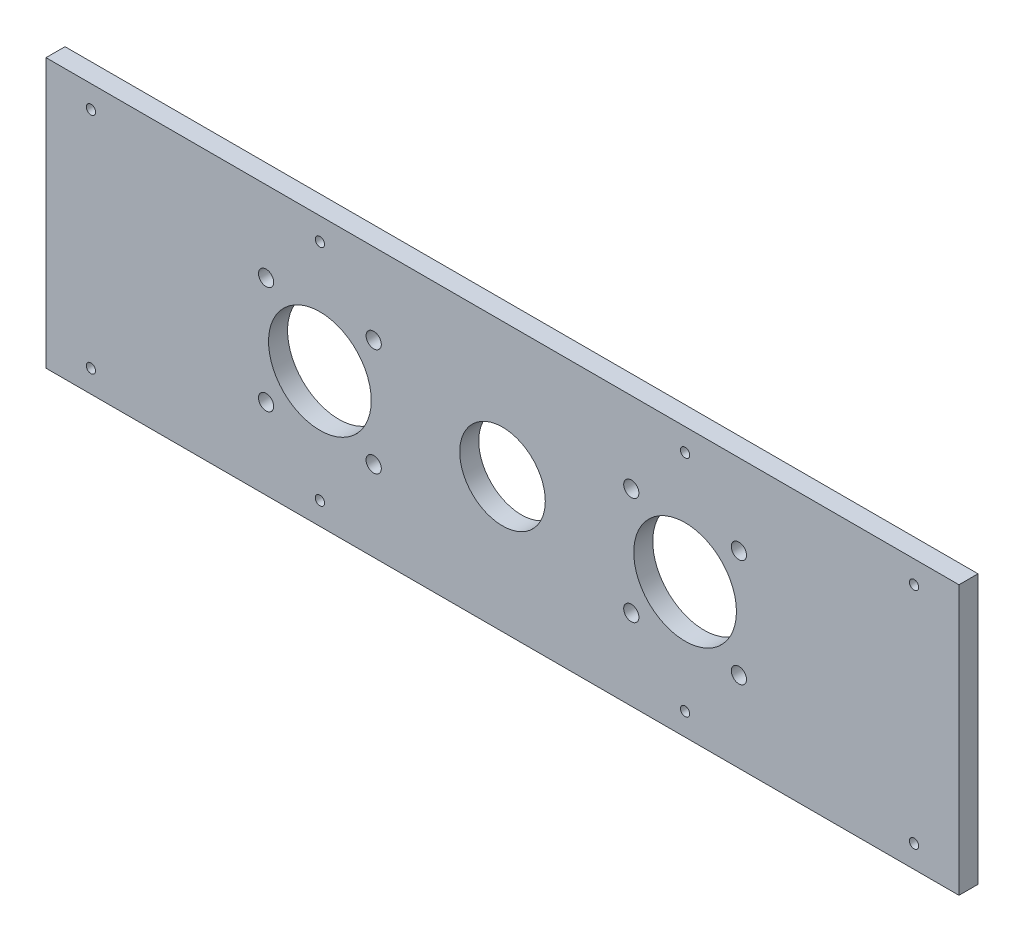
ISO-10303-21;
HEADER;
FILE_DESCRIPTION(('STEP AP214'),'2;1');
FILE_NAME('part.step','',(''),(''),'','','');
FILE_SCHEMA(('AUTOMOTIVE_DESIGN { 1 0 10303 214 1 1 1 1 }'));
ENDSEC;
DATA;
#1=APPLICATION_CONTEXT('core data for automotive mechanical design processes');
#2=APPLICATION_PROTOCOL_DEFINITION('international standard','automotive_design',2000,#1);
#3=PRODUCT_CONTEXT('',#1,'mechanical');
#4=PRODUCT('Part','Part','',(#3));
#5=PRODUCT_RELATED_PRODUCT_CATEGORY('part','',(#4));
#6=PRODUCT_DEFINITION_FORMATION('','',#4);
#7=PRODUCT_DEFINITION_CONTEXT('part definition',#1,'design');
#8=PRODUCT_DEFINITION('design','',#6,#7);
#9=PRODUCT_DEFINITION_SHAPE('','',#8);
#10=(LENGTH_UNIT() NAMED_UNIT(*) SI_UNIT(.MILLI.,.METRE.));
#11=(NAMED_UNIT(*) PLANE_ANGLE_UNIT() SI_UNIT($,.RADIAN.));
#12=(NAMED_UNIT(*) SI_UNIT($,.STERADIAN.) SOLID_ANGLE_UNIT());
#13=UNCERTAINTY_MEASURE_WITH_UNIT(LENGTH_MEASURE(1.E-05),#10,'distance_accuracy_value','');
#14=(GEOMETRIC_REPRESENTATION_CONTEXT(3) GLOBAL_UNCERTAINTY_ASSIGNED_CONTEXT((#13)) GLOBAL_UNIT_ASSIGNED_CONTEXT((#10,
#11,#12)) REPRESENTATION_CONTEXT('',''));
#15=CARTESIAN_POINT('',(0.,0.,0.));
#16=DIRECTION('',(0.,0.,1.));
#17=DIRECTION('',(1.,0.,0.));
#18=AXIS2_PLACEMENT_3D('',#15,#16,#17);
#19=CARTESIAN_POINT('',(0.,0.,6.35));
#20=DIRECTION('',(0.,0.,-1.));
#21=DIRECTION('',(-1.,0.,0.));
#22=AXIS2_PLACEMENT_3D('',#19,#20,#21);
#23=PLANE('',#22);
#24=CARTESIAN_POINT('',(213.36,82.3,6.35));
#25=DIRECTION('',(0.,0.,-1.));
#26=DIRECTION('',(-1.,0.,0.));
#27=AXIS2_PLACEMENT_3D('',#24,#25,#26);
#28=CIRCLE('',#27,1.54999999999999);
#29=CARTESIAN_POINT('',(211.81,82.3,6.35));
#30=VERTEX_POINT('',#29);
#31=EDGE_CURVE('E214',#30,#30,#28,.T.);
#32=ORIENTED_EDGE('',*,*,#31,.T.);
#33=EDGE_LOOP('',(#32));
#34=FACE_BOUND('',#33,.T.);
#35=CARTESIAN_POINT('',(91.44,82.3,6.35));
#36=DIRECTION('',(0.,0.,-1.));
#37=DIRECTION('',(-1.,0.,0.));
#38=AXIS2_PLACEMENT_3D('',#35,#36,#37);
#39=CIRCLE('',#38,1.54999999999999);
#40=CARTESIAN_POINT('',(89.89,82.3,6.35));
#41=VERTEX_POINT('',#40);
#42=EDGE_CURVE('E221',#41,#41,#39,.T.);
#43=ORIENTED_EDGE('',*,*,#42,.T.);
#44=EDGE_LOOP('',(#43));
#45=FACE_BOUND('',#44,.T.);
#46=CARTESIAN_POINT('',(15.,82.3,6.35));
#47=DIRECTION('',(0.,0.,-1.));
#48=DIRECTION('',(-1.,0.,0.));
#49=AXIS2_PLACEMENT_3D('',#46,#47,#48);
#50=CIRCLE('',#49,1.54999999999999);
#51=CARTESIAN_POINT('',(13.45,82.3,6.35));
#52=VERTEX_POINT('',#51);
#53=EDGE_CURVE('E225',#52,#52,#50,.T.);
#54=ORIENTED_EDGE('',*,*,#53,.T.);
#55=EDGE_LOOP('',(#54));
#56=FACE_BOUND('',#55,.T.);
#57=CARTESIAN_POINT('',(15.,7.50000000000001,6.35));
#58=DIRECTION('',(0.,0.,-1.));
#59=DIRECTION('',(-1.,0.,0.));
#60=AXIS2_PLACEMENT_3D('',#57,#58,#59);
#61=CIRCLE('',#60,1.54999999999999);
#62=CARTESIAN_POINT('',(13.45,7.50000000000001,6.35));
#63=VERTEX_POINT('',#62);
#64=EDGE_CURVE('E229',#63,#63,#61,.T.);
#65=ORIENTED_EDGE('',*,*,#64,.T.);
#66=EDGE_LOOP('',(#65));
#67=FACE_BOUND('',#66,.T.);
#68=CARTESIAN_POINT('',(91.44,7.50000000000001,6.35));
#69=DIRECTION('',(0.,0.,-1.));
#70=DIRECTION('',(-1.,0.,0.));
#71=AXIS2_PLACEMENT_3D('',#68,#69,#70);
#72=CIRCLE('',#71,1.54999999999999);
#73=CARTESIAN_POINT('',(89.89,7.50000000000001,6.35));
#74=VERTEX_POINT('',#73);
#75=EDGE_CURVE('E233',#74,#74,#72,.T.);
#76=ORIENTED_EDGE('',*,*,#75,.T.);
#77=EDGE_LOOP('',(#76));
#78=FACE_BOUND('',#77,.T.);
#79=CARTESIAN_POINT('',(213.36,7.50000000000001,6.35));
#80=DIRECTION('',(0.,0.,-1.));
#81=DIRECTION('',(-1.,0.,0.));
#82=AXIS2_PLACEMENT_3D('',#79,#80,#81);
#83=CIRCLE('',#82,1.54999999999999);
#84=CARTESIAN_POINT('',(211.81,7.50000000000001,6.35));
#85=VERTEX_POINT('',#84);
#86=EDGE_CURVE('E237',#85,#85,#83,.T.);
#87=ORIENTED_EDGE('',*,*,#86,.T.);
#88=EDGE_LOOP('',(#87));
#89=FACE_BOUND('',#88,.T.);
#90=CARTESIAN_POINT('',(289.8,7.50000000000001,6.35));
#91=DIRECTION('',(0.,0.,-1.));
#92=DIRECTION('',(-1.,0.,0.));
#93=AXIS2_PLACEMENT_3D('',#90,#91,#92);
#94=CIRCLE('',#93,1.54999999999999);
#95=CARTESIAN_POINT('',(288.25,7.50000000000001,6.35));
#96=VERTEX_POINT('',#95);
#97=EDGE_CURVE('E241',#96,#96,#94,.T.);
#98=ORIENTED_EDGE('',*,*,#97,.T.);
#99=EDGE_LOOP('',(#98));
#100=FACE_BOUND('',#99,.T.);
#101=CARTESIAN_POINT('',(289.8,82.3,6.35));
#102=DIRECTION('',(0.,0.,-1.));
#103=DIRECTION('',(-1.,0.,0.));
#104=AXIS2_PLACEMENT_3D('',#101,#102,#103);
#105=CIRCLE('',#104,1.54999999999999);
#106=CARTESIAN_POINT('',(288.25,82.3,6.35));
#107=VERTEX_POINT('',#106);
#108=EDGE_CURVE('E245',#107,#107,#105,.T.);
#109=ORIENTED_EDGE('',*,*,#108,.T.);
#110=EDGE_LOOP('',(#109));
#111=FACE_BOUND('',#110,.T.);
#112=DIRECTION('',(0.,-1.,0.));
#113=VECTOR('',#112,1.);
#114=CARTESIAN_POINT('',(0.,0.,6.35));
#115=LINE('',#114,#113);
#116=CARTESIAN_POINT('',(0.,89.8,6.35));
#117=VERTEX_POINT('',#116);
#118=CARTESIAN_POINT('',(0.,0.,6.35));
#119=VERTEX_POINT('',#118);
#120=EDGE_CURVE('E92',#117,#119,#115,.T.);
#121=ORIENTED_EDGE('',*,*,#120,.T.);
#122=DIRECTION('',(1.,0.,0.));
#123=VECTOR('',#122,1.);
#124=CARTESIAN_POINT('',(0.,0.,6.35));
#125=LINE('',#124,#123);
#126=CARTESIAN_POINT('',(304.8,0.,6.35));
#127=VERTEX_POINT('',#126);
#128=EDGE_CURVE('E87',#119,#127,#125,.T.);
#129=ORIENTED_EDGE('',*,*,#128,.T.);
#130=DIRECTION('',(0.,1.,0.));
#131=VECTOR('',#130,1.);
#132=CARTESIAN_POINT('',(304.8,0.,6.35));
#133=LINE('',#132,#131);
#134=CARTESIAN_POINT('',(304.8,89.8,6.35));
#135=VERTEX_POINT('',#134);
#136=EDGE_CURVE('E90',#127,#135,#133,.T.);
#137=ORIENTED_EDGE('',*,*,#136,.T.);
#138=DIRECTION('',(-1.,0.,0.));
#139=VECTOR('',#138,1.);
#140=CARTESIAN_POINT('',(0.,89.8,6.35));
#141=LINE('',#140,#139);
#142=EDGE_CURVE('E57',#135,#117,#141,.T.);
#143=ORIENTED_EDGE('',*,*,#142,.T.);
#144=EDGE_LOOP('',(#121,#129,#137,#143));
#145=FACE_BOUND('',#144,.T.);
#146=CARTESIAN_POINT('',(152.4,44.9,6.35));
#147=DIRECTION('',(0.,0.,1.));
#148=DIRECTION('',(1.,0.,0.));
#149=AXIS2_PLACEMENT_3D('',#146,#147,#148);
#150=CIRCLE('',#149,14.2875);
#151=CARTESIAN_POINT('',(166.6875,44.9,6.35));
#152=VERTEX_POINT('',#151);
#153=EDGE_CURVE('E112',#152,#152,#150,.T.);
#154=ORIENTED_EDGE('',*,*,#153,.F.);
#155=EDGE_LOOP('',(#154));
#156=FACE_BOUND('',#155,.T.);
#157=CARTESIAN_POINT('',(91.44,44.9,6.35));
#158=DIRECTION('',(0.,0.,1.));
#159=DIRECTION('',(1.,0.,0.));
#160=AXIS2_PLACEMENT_3D('',#157,#158,#159);
#161=CIRCLE('',#160,17.145);
#162=CARTESIAN_POINT('',(108.585,44.9,6.35));
#163=VERTEX_POINT('',#162);
#164=EDGE_CURVE('E134',#163,#163,#161,.T.);
#165=ORIENTED_EDGE('',*,*,#164,.F.);
#166=EDGE_LOOP('',(#165));
#167=FACE_BOUND('',#166,.T.);
#168=CARTESIAN_POINT('',(109.401585406358,62.8594390137919,6.35));
#169=DIRECTION('',(0.,0.,1.));
#170=DIRECTION('',(1.,0.,0.));
#171=AXIS2_PLACEMENT_3D('',#168,#169,#170);
#172=CIRCLE('',#171,2.54000000000001);
#173=CARTESIAN_POINT('',(111.941585406358,62.8594390137919,6.35));
#174=VERTEX_POINT('',#173);
#175=EDGE_CURVE('E142',#174,#174,#172,.T.);
#176=ORIENTED_EDGE('',*,*,#175,.F.);
#177=EDGE_LOOP('',(#176));
#178=FACE_BOUND('',#177,.T.);
#179=CARTESIAN_POINT('',(109.399439013792,26.938414593642,6.35));
#180=DIRECTION('',(0.,0.,1.));
#181=DIRECTION('',(1.,0.,0.));
#182=AXIS2_PLACEMENT_3D('',#179,#180,#181);
#183=CIRCLE('',#182,2.54);
#184=CARTESIAN_POINT('',(111.939439013792,26.938414593642,6.35));
#185=VERTEX_POINT('',#184);
#186=EDGE_CURVE('E150',#185,#185,#183,.T.);
#187=ORIENTED_EDGE('',*,*,#186,.F.);
#188=EDGE_LOOP('',(#187));
#189=FACE_BOUND('',#188,.T.);
#190=CARTESIAN_POINT('',(73.4784145936425,26.9405609862077,6.35));
#191=DIRECTION('',(0.,0.,1.));
#192=DIRECTION('',(1.,0.,0.));
#193=AXIS2_PLACEMENT_3D('',#190,#191,#192);
#194=CIRCLE('',#193,2.54000000000001);
#195=CARTESIAN_POINT('',(76.0184145936425,26.9405609862077,6.35));
#196=VERTEX_POINT('',#195);
#197=EDGE_CURVE('E158',#196,#196,#194,.T.);
#198=ORIENTED_EDGE('',*,*,#197,.F.);
#199=EDGE_LOOP('',(#198));
#200=FACE_BOUND('',#199,.T.);
#201=CARTESIAN_POINT('',(73.4805609862082,62.8615854063576,6.35));
#202=DIRECTION('',(0.,0.,1.));
#203=DIRECTION('',(1.,0.,0.));
#204=AXIS2_PLACEMENT_3D('',#201,#202,#203);
#205=CIRCLE('',#204,2.53999999999999);
#206=CARTESIAN_POINT('',(76.0205609862082,62.8615854063576,6.35));
#207=VERTEX_POINT('',#206);
#208=EDGE_CURVE('E166',#207,#207,#205,.T.);
#209=ORIENTED_EDGE('',*,*,#208,.F.);
#210=EDGE_LOOP('',(#209));
#211=FACE_BOUND('',#210,.T.);
#212=CARTESIAN_POINT('',(213.36,44.9,6.35));
#213=DIRECTION('',(0.,0.,1.));
#214=DIRECTION('',(1.,0.,0.));
#215=AXIS2_PLACEMENT_3D('',#212,#213,#214);
#216=CIRCLE('',#215,17.145);
#217=CARTESIAN_POINT('',(230.505,44.9,6.35));
#218=VERTEX_POINT('',#217);
#219=EDGE_CURVE('E174',#218,#218,#216,.T.);
#220=ORIENTED_EDGE('',*,*,#219,.F.);
#221=EDGE_LOOP('',(#220));
#222=FACE_BOUND('',#221,.T.);
#223=CARTESIAN_POINT('',(195.400560986209,62.8615854063583,6.35));
#224=DIRECTION('',(0.,0.,1.));
#225=DIRECTION('',(1.,0.,0.));
#226=AXIS2_PLACEMENT_3D('',#223,#224,#225);
#227=CIRCLE('',#226,2.54000000000004);
#228=CARTESIAN_POINT('',(197.940560986209,62.8615854063583,6.35));
#229=VERTEX_POINT('',#228);
#230=EDGE_CURVE('E182',#229,#229,#227,.T.);
#231=ORIENTED_EDGE('',*,*,#230,.F.);
#232=EDGE_LOOP('',(#231));
#233=FACE_BOUND('',#232,.T.);
#234=CARTESIAN_POINT('',(231.321585406358,62.8594390137919,6.35));
#235=DIRECTION('',(0.,0.,1.));
#236=DIRECTION('',(1.,0.,0.));
#237=AXIS2_PLACEMENT_3D('',#234,#235,#236);
#238=CIRCLE('',#237,2.54);
#239=CARTESIAN_POINT('',(233.861585406358,62.8594390137919,6.35));
#240=VERTEX_POINT('',#239);
#241=EDGE_CURVE('E190',#240,#240,#238,.T.);
#242=ORIENTED_EDGE('',*,*,#241,.F.);
#243=EDGE_LOOP('',(#242));
#244=FACE_BOUND('',#243,.T.);
#245=CARTESIAN_POINT('',(231.319439013792,26.938414593642,6.35));
#246=DIRECTION('',(0.,0.,1.));
#247=DIRECTION('',(1.,0.,0.));
#248=AXIS2_PLACEMENT_3D('',#245,#246,#247);
#249=CIRCLE('',#248,2.54000000000003);
#250=CARTESIAN_POINT('',(233.859439013792,26.938414593642,6.35));
#251=VERTEX_POINT('',#250);
#252=EDGE_CURVE('E198',#251,#251,#249,.T.);
#253=ORIENTED_EDGE('',*,*,#252,.F.);
#254=EDGE_LOOP('',(#253));
#255=FACE_BOUND('',#254,.T.);
#256=CARTESIAN_POINT('',(195.398414593642,26.9405609862087,6.35));
#257=DIRECTION('',(0.,0.,1.));
#258=DIRECTION('',(1.,0.,0.));
#259=AXIS2_PLACEMENT_3D('',#256,#257,#258);
#260=CIRCLE('',#259,2.54);
#261=CARTESIAN_POINT('',(197.938414593642,26.9405609862087,6.35));
#262=VERTEX_POINT('',#261);
#263=EDGE_CURVE('E206',#262,#262,#260,.T.);
#264=ORIENTED_EDGE('',*,*,#263,.F.);
#265=EDGE_LOOP('',(#264));
#266=FACE_BOUND('',#265,.T.);
#267=ADVANCED_FACE('F39',(#34,#45,#56,#67,#78,#89,#100,#111,#145,#156,#167,#178,#189,#200,#211,
#222,#233,#244,#255,#266),#23,.F.);
#268=CARTESIAN_POINT('',(0.,0.,0.));
#269=DIRECTION('',(0.,0.,-1.));
#270=DIRECTION('',(-1.,0.,0.));
#271=AXIS2_PLACEMENT_3D('',#268,#269,#270);
#272=PLANE('',#271);
#273=CARTESIAN_POINT('',(213.36,82.3,0.));
#274=DIRECTION('',(0.,0.,-1.));
#275=DIRECTION('',(-1.,0.,0.));
#276=AXIS2_PLACEMENT_3D('',#273,#274,#275);
#277=CIRCLE('',#276,1.54999999999999);
#278=CARTESIAN_POINT('',(211.81,82.3,0.));
#279=VERTEX_POINT('',#278);
#280=EDGE_CURVE('E253',#279,#279,#277,.T.);
#281=ORIENTED_EDGE('',*,*,#280,.F.);
#282=EDGE_LOOP('',(#281));
#283=FACE_BOUND('',#282,.T.);
#284=CARTESIAN_POINT('',(91.44,82.3,0.));
#285=DIRECTION('',(0.,0.,-1.));
#286=DIRECTION('',(1.,0.,0.));
#287=AXIS2_PLACEMENT_3D('',#284,#285,#286);
#288=CIRCLE('',#287,1.54999999999999);
#289=CARTESIAN_POINT('',(92.99,82.3,0.));
#290=VERTEX_POINT('',#289);
#291=EDGE_CURVE('E263',#290,#290,#288,.T.);
#292=ORIENTED_EDGE('',*,*,#291,.F.);
#293=EDGE_LOOP('',(#292));
#294=FACE_BOUND('',#293,.T.);
#295=CARTESIAN_POINT('',(15.,82.3,0.));
#296=DIRECTION('',(0.,0.,-1.));
#297=DIRECTION('',(1.,0.,0.));
#298=AXIS2_PLACEMENT_3D('',#295,#296,#297);
#299=CIRCLE('',#298,1.54999999999999);
#300=CARTESIAN_POINT('',(16.55,82.3,0.));
#301=VERTEX_POINT('',#300);
#302=EDGE_CURVE('E258',#301,#301,#299,.T.);
#303=ORIENTED_EDGE('',*,*,#302,.F.);
#304=EDGE_LOOP('',(#303));
#305=FACE_BOUND('',#304,.T.);
#306=CARTESIAN_POINT('',(15.,7.50000000000001,0.));
#307=DIRECTION('',(0.,0.,-1.));
#308=DIRECTION('',(-1.,0.,0.));
#309=AXIS2_PLACEMENT_3D('',#306,#307,#308);
#310=CIRCLE('',#309,1.54999999999999);
#311=CARTESIAN_POINT('',(13.45,7.50000000000001,0.));
#312=VERTEX_POINT('',#311);
#313=EDGE_CURVE('E254',#312,#312,#310,.T.);
#314=ORIENTED_EDGE('',*,*,#313,.F.);
#315=EDGE_LOOP('',(#314));
#316=FACE_BOUND('',#315,.T.);
#317=CARTESIAN_POINT('',(91.44,7.50000000000001,0.));
#318=DIRECTION('',(0.,0.,-1.));
#319=DIRECTION('',(-1.,0.,0.));
#320=AXIS2_PLACEMENT_3D('',#317,#318,#319);
#321=CIRCLE('',#320,1.54999999999999);
#322=CARTESIAN_POINT('',(89.89,7.50000000000001,0.));
#323=VERTEX_POINT('',#322);
#324=EDGE_CURVE('E259',#323,#323,#321,.T.);
#325=ORIENTED_EDGE('',*,*,#324,.F.);
#326=EDGE_LOOP('',(#325));
#327=FACE_BOUND('',#326,.T.);
#328=CARTESIAN_POINT('',(213.36,7.50000000000001,0.));
#329=DIRECTION('',(0.,0.,-1.));
#330=DIRECTION('',(1.,0.,0.));
#331=AXIS2_PLACEMENT_3D('',#328,#329,#330);
#332=CIRCLE('',#331,1.54999999999999);
#333=CARTESIAN_POINT('',(214.91,7.50000000000001,0.));
#334=VERTEX_POINT('',#333);
#335=EDGE_CURVE('E274',#334,#334,#332,.T.);
#336=ORIENTED_EDGE('',*,*,#335,.F.);
#337=EDGE_LOOP('',(#336));
#338=FACE_BOUND('',#337,.T.);
#339=CARTESIAN_POINT('',(289.8,7.50000000000001,0.));
#340=DIRECTION('',(0.,0.,-1.));
#341=DIRECTION('',(1.,0.,0.));
#342=AXIS2_PLACEMENT_3D('',#339,#340,#341);
#343=CIRCLE('',#342,1.54999999999999);
#344=CARTESIAN_POINT('',(291.35,7.50000000000001,0.));
#345=VERTEX_POINT('',#344);
#346=EDGE_CURVE('E270',#345,#345,#343,.T.);
#347=ORIENTED_EDGE('',*,*,#346,.F.);
#348=EDGE_LOOP('',(#347));
#349=FACE_BOUND('',#348,.T.);
#350=CARTESIAN_POINT('',(289.8,82.3,0.));
#351=DIRECTION('',(0.,0.,-1.));
#352=DIRECTION('',(-1.,0.,0.));
#353=AXIS2_PLACEMENT_3D('',#350,#351,#352);
#354=CIRCLE('',#353,1.54999999999999);
#355=CARTESIAN_POINT('',(288.25,82.3,0.));
#356=VERTEX_POINT('',#355);
#357=EDGE_CURVE('E249',#356,#356,#354,.T.);
#358=ORIENTED_EDGE('',*,*,#357,.F.);
#359=EDGE_LOOP('',(#358));
#360=FACE_BOUND('',#359,.T.);
#361=CARTESIAN_POINT('',(231.319439013792,26.938414593642,0.));
#362=DIRECTION('',(0.,0.,1.));
#363=DIRECTION('',(1.,0.,0.));
#364=AXIS2_PLACEMENT_3D('',#361,#362,#363);
#365=CIRCLE('',#364,2.54000000000003);
#366=CARTESIAN_POINT('',(233.859439013792,26.938414593642,0.));
#367=VERTEX_POINT('',#366);
#368=EDGE_CURVE('E202',#367,#367,#365,.T.);
#369=ORIENTED_EDGE('',*,*,#368,.T.);
#370=EDGE_LOOP('',(#369));
#371=FACE_BOUND('',#370,.T.);
#372=CARTESIAN_POINT('',(195.400560986209,62.8615854063583,0.));
#373=DIRECTION('',(0.,0.,1.));
#374=DIRECTION('',(1.,0.,0.));
#375=AXIS2_PLACEMENT_3D('',#372,#373,#374);
#376=CIRCLE('',#375,2.54000000000004);
#377=CARTESIAN_POINT('',(197.940560986209,62.8615854063583,0.));
#378=VERTEX_POINT('',#377);
#379=EDGE_CURVE('E186',#378,#378,#376,.T.);
#380=ORIENTED_EDGE('',*,*,#379,.T.);
#381=EDGE_LOOP('',(#380));
#382=FACE_BOUND('',#381,.T.);
#383=CARTESIAN_POINT('',(73.4805609862082,62.8615854063576,0.));
#384=DIRECTION('',(0.,0.,1.));
#385=DIRECTION('',(1.,0.,0.));
#386=AXIS2_PLACEMENT_3D('',#383,#384,#385);
#387=CIRCLE('',#386,2.53999999999999);
#388=CARTESIAN_POINT('',(76.0205609862082,62.8615854063576,0.));
#389=VERTEX_POINT('',#388);
#390=EDGE_CURVE('E170',#389,#389,#387,.T.);
#391=ORIENTED_EDGE('',*,*,#390,.T.);
#392=EDGE_LOOP('',(#391));
#393=FACE_BOUND('',#392,.T.);
#394=CARTESIAN_POINT('',(109.399439013792,26.938414593642,0.));
#395=DIRECTION('',(0.,0.,1.));
#396=DIRECTION('',(1.,0.,0.));
#397=AXIS2_PLACEMENT_3D('',#394,#395,#396);
#398=CIRCLE('',#397,2.54);
#399=CARTESIAN_POINT('',(111.939439013792,26.938414593642,0.));
#400=VERTEX_POINT('',#399);
#401=EDGE_CURVE('E154',#400,#400,#398,.T.);
#402=ORIENTED_EDGE('',*,*,#401,.T.);
#403=EDGE_LOOP('',(#402));
#404=FACE_BOUND('',#403,.T.);
#405=CARTESIAN_POINT('',(91.44,44.9,0.));
#406=DIRECTION('',(0.,0.,1.));
#407=DIRECTION('',(1.,0.,0.));
#408=AXIS2_PLACEMENT_3D('',#405,#406,#407);
#409=CIRCLE('',#408,17.145);
#410=CARTESIAN_POINT('',(108.585,44.9,0.));
#411=VERTEX_POINT('',#410);
#412=EDGE_CURVE('E138',#411,#411,#409,.T.);
#413=ORIENTED_EDGE('',*,*,#412,.T.);
#414=EDGE_LOOP('',(#413));
#415=FACE_BOUND('',#414,.T.);
#416=DIRECTION('',(0.,-1.,0.));
#417=VECTOR('',#416,1.);
#418=CARTESIAN_POINT('',(0.,0.,0.));
#419=LINE('',#418,#417);
#420=CARTESIAN_POINT('',(0.,89.8,0.));
#421=VERTEX_POINT('',#420);
#422=CARTESIAN_POINT('',(0.,0.,0.));
#423=VERTEX_POINT('',#422);
#424=EDGE_CURVE('E108',#421,#423,#419,.T.);
#425=ORIENTED_EDGE('',*,*,#424,.F.);
#426=DIRECTION('',(-1.,0.,0.));
#427=VECTOR('',#426,1.);
#428=CARTESIAN_POINT('',(0.,89.8,0.));
#429=LINE('',#428,#427);
#430=CARTESIAN_POINT('',(304.8,89.8,0.));
#431=VERTEX_POINT('',#430);
#432=EDGE_CURVE('E80',#431,#421,#429,.T.);
#433=ORIENTED_EDGE('',*,*,#432,.F.);
#434=DIRECTION('',(0.,1.,0.));
#435=VECTOR('',#434,1.);
#436=CARTESIAN_POINT('',(304.8,0.,0.));
#437=LINE('',#436,#435);
#438=CARTESIAN_POINT('',(304.8,0.,0.));
#439=VERTEX_POINT('',#438);
#440=EDGE_CURVE('E74',#439,#431,#437,.T.);
#441=ORIENTED_EDGE('',*,*,#440,.F.);
#442=DIRECTION('',(1.,0.,0.));
#443=VECTOR('',#442,1.);
#444=CARTESIAN_POINT('',(0.,0.,0.));
#445=LINE('',#444,#443);
#446=EDGE_CURVE('E97',#423,#439,#445,.T.);
#447=ORIENTED_EDGE('',*,*,#446,.F.);
#448=EDGE_LOOP('',(#425,#433,#441,#447));
#449=FACE_BOUND('',#448,.T.);
#450=CARTESIAN_POINT('',(152.4,44.9,0.));
#451=DIRECTION('',(0.,0.,1.));
#452=DIRECTION('',(1.,0.,0.));
#453=AXIS2_PLACEMENT_3D('',#450,#451,#452);
#454=CIRCLE('',#453,14.2875);
#455=CARTESIAN_POINT('',(166.6875,44.9,0.));
#456=VERTEX_POINT('',#455);
#457=EDGE_CURVE('E130',#456,#456,#454,.T.);
#458=ORIENTED_EDGE('',*,*,#457,.T.);
#459=EDGE_LOOP('',(#458));
#460=FACE_BOUND('',#459,.T.);
#461=CARTESIAN_POINT('',(109.401585406358,62.8594390137919,0.));
#462=DIRECTION('',(0.,0.,1.));
#463=DIRECTION('',(1.,0.,0.));
#464=AXIS2_PLACEMENT_3D('',#461,#462,#463);
#465=CIRCLE('',#464,2.54000000000001);
#466=CARTESIAN_POINT('',(111.941585406358,62.8594390137919,0.));
#467=VERTEX_POINT('',#466);
#468=EDGE_CURVE('E146',#467,#467,#465,.T.);
#469=ORIENTED_EDGE('',*,*,#468,.T.);
#470=EDGE_LOOP('',(#469));
#471=FACE_BOUND('',#470,.T.);
#472=CARTESIAN_POINT('',(73.4784145936425,26.9405609862077,0.));
#473=DIRECTION('',(0.,0.,1.));
#474=DIRECTION('',(1.,0.,0.));
#475=AXIS2_PLACEMENT_3D('',#472,#473,#474);
#476=CIRCLE('',#475,2.54000000000001);
#477=CARTESIAN_POINT('',(76.0184145936425,26.9405609862077,0.));
#478=VERTEX_POINT('',#477);
#479=EDGE_CURVE('E162',#478,#478,#476,.T.);
#480=ORIENTED_EDGE('',*,*,#479,.T.);
#481=EDGE_LOOP('',(#480));
#482=FACE_BOUND('',#481,.T.);
#483=CARTESIAN_POINT('',(213.36,44.9,0.));
#484=DIRECTION('',(0.,0.,1.));
#485=DIRECTION('',(1.,0.,0.));
#486=AXIS2_PLACEMENT_3D('',#483,#484,#485);
#487=CIRCLE('',#486,17.145);
#488=CARTESIAN_POINT('',(230.505,44.9,0.));
#489=VERTEX_POINT('',#488);
#490=EDGE_CURVE('E178',#489,#489,#487,.T.);
#491=ORIENTED_EDGE('',*,*,#490,.T.);
#492=EDGE_LOOP('',(#491));
#493=FACE_BOUND('',#492,.T.);
#494=CARTESIAN_POINT('',(231.321585406358,62.8594390137919,0.));
#495=DIRECTION('',(0.,0.,1.));
#496=DIRECTION('',(1.,0.,0.));
#497=AXIS2_PLACEMENT_3D('',#494,#495,#496);
#498=CIRCLE('',#497,2.54);
#499=CARTESIAN_POINT('',(233.861585406358,62.8594390137919,0.));
#500=VERTEX_POINT('',#499);
#501=EDGE_CURVE('E194',#500,#500,#498,.T.);
#502=ORIENTED_EDGE('',*,*,#501,.T.);
#503=EDGE_LOOP('',(#502));
#504=FACE_BOUND('',#503,.T.);
#505=CARTESIAN_POINT('',(195.398414593642,26.9405609862087,0.));
#506=DIRECTION('',(0.,0.,1.));
#507=DIRECTION('',(1.,0.,0.));
#508=AXIS2_PLACEMENT_3D('',#505,#506,#507);
#509=CIRCLE('',#508,2.54);
#510=CARTESIAN_POINT('',(197.938414593642,26.9405609862087,0.));
#511=VERTEX_POINT('',#510);
#512=EDGE_CURVE('E210',#511,#511,#509,.T.);
#513=ORIENTED_EDGE('',*,*,#512,.T.);
#514=EDGE_LOOP('',(#513));
#515=FACE_BOUND('',#514,.T.);
#516=ADVANCED_FACE('F125',(#283,#294,#305,#316,#327,#338,#349,#360,#371,#382,#393,#404,#415,
#449,#460,#471,#482,#493,#504,#515),#272,.T.);
#517=CARTESIAN_POINT('',(0.,0.,6.35));
#518=DIRECTION('',(1.,0.,0.));
#519=DIRECTION('',(0.,0.,-1.));
#520=AXIS2_PLACEMENT_3D('',#517,#518,#519);
#521=PLANE('',#520);
#522=ORIENTED_EDGE('',*,*,#424,.T.);
#523=DIRECTION('',(0.,0.,-1.));
#524=VECTOR('',#523,1.);
#525=CARTESIAN_POINT('',(0.,0.,6.35));
#526=LINE('',#525,#524);
#527=EDGE_CURVE('E11',#119,#423,#526,.T.);
#528=ORIENTED_EDGE('',*,*,#527,.F.);
#529=ORIENTED_EDGE('',*,*,#120,.F.);
#530=DIRECTION('',(0.,0.,-1.));
#531=VECTOR('',#530,1.);
#532=CARTESIAN_POINT('',(0.,89.8,6.35));
#533=LINE('',#532,#531);
#534=EDGE_CURVE('E104',#117,#421,#533,.T.);
#535=ORIENTED_EDGE('',*,*,#534,.T.);
#536=EDGE_LOOP('',(#522,#528,#529,#535));
#537=FACE_BOUND('',#536,.T.);
#538=ADVANCED_FACE('F41',(#537),#521,.F.);
#539=CARTESIAN_POINT('',(0.,0.,6.35));
#540=DIRECTION('',(0.,1.,0.));
#541=DIRECTION('',(0.,0.,1.));
#542=AXIS2_PLACEMENT_3D('',#539,#540,#541);
#543=PLANE('',#542);
#544=ORIENTED_EDGE('',*,*,#446,.T.);
#545=DIRECTION('',(0.,0.,-1.));
#546=VECTOR('',#545,1.);
#547=CARTESIAN_POINT('',(304.8,0.,6.35));
#548=LINE('',#547,#546);
#549=EDGE_CURVE('E49',#127,#439,#548,.T.);
#550=ORIENTED_EDGE('',*,*,#549,.F.);
#551=ORIENTED_EDGE('',*,*,#128,.F.);
#552=ORIENTED_EDGE('',*,*,#527,.T.);
#553=EDGE_LOOP('',(#544,#550,#551,#552));
#554=FACE_BOUND('',#553,.T.);
#555=ADVANCED_FACE('F96',(#554),#543,.F.);
#556=CARTESIAN_POINT('',(304.8,0.,6.35));
#557=DIRECTION('',(-1.,0.,0.));
#558=DIRECTION('',(0.,0.,1.));
#559=AXIS2_PLACEMENT_3D('',#556,#557,#558);
#560=PLANE('',#559);
#561=ORIENTED_EDGE('',*,*,#440,.T.);
#562=DIRECTION('',(0.,0.,-1.));
#563=VECTOR('',#562,1.);
#564=CARTESIAN_POINT('',(304.8,89.8,6.35));
#565=LINE('',#564,#563);
#566=EDGE_CURVE('E99',#135,#431,#565,.T.);
#567=ORIENTED_EDGE('',*,*,#566,.F.);
#568=ORIENTED_EDGE('',*,*,#136,.F.);
#569=ORIENTED_EDGE('',*,*,#549,.T.);
#570=EDGE_LOOP('',(#561,#567,#568,#569));
#571=FACE_BOUND('',#570,.T.);
#572=ADVANCED_FACE('F100',(#571),#560,.F.);
#573=CARTESIAN_POINT('',(0.,89.8,6.35));
#574=DIRECTION('',(0.,-1.,0.));
#575=DIRECTION('',(0.,0.,-1.));
#576=AXIS2_PLACEMENT_3D('',#573,#574,#575);
#577=PLANE('',#576);
#578=ORIENTED_EDGE('',*,*,#432,.T.);
#579=ORIENTED_EDGE('',*,*,#534,.F.);
#580=ORIENTED_EDGE('',*,*,#142,.F.);
#581=ORIENTED_EDGE('',*,*,#566,.T.);
#582=EDGE_LOOP('',(#578,#579,#580,#581));
#583=FACE_BOUND('',#582,.T.);
#584=ADVANCED_FACE('F122',(#583),#577,.F.);
#585=CARTESIAN_POINT('',(152.4,44.9,6.35));
#586=DIRECTION('',(0.,0.,-1.));
#587=DIRECTION('',(-1.,0.,0.));
#588=AXIS2_PLACEMENT_3D('',#585,#586,#587);
#589=CYLINDRICAL_SURFACE('',#588,14.2875);
#590=ORIENTED_EDGE('',*,*,#153,.T.);
#591=EDGE_LOOP('',(#590));
#592=FACE_BOUND('',#591,.T.);
#593=ORIENTED_EDGE('',*,*,#457,.F.);
#594=EDGE_LOOP('',(#593));
#595=FACE_BOUND('',#594,.T.);
#596=ADVANCED_FACE('F308',(#592,#595),#589,.F.);
#597=CARTESIAN_POINT('',(91.44,44.9,6.35));
#598=DIRECTION('',(0.,0.,-1.));
#599=DIRECTION('',(-1.,0.,0.));
#600=AXIS2_PLACEMENT_3D('',#597,#598,#599);
#601=CYLINDRICAL_SURFACE('',#600,17.145);
#602=ORIENTED_EDGE('',*,*,#164,.T.);
#603=EDGE_LOOP('',(#602));
#604=FACE_BOUND('',#603,.T.);
#605=ORIENTED_EDGE('',*,*,#412,.F.);
#606=EDGE_LOOP('',(#605));
#607=FACE_BOUND('',#606,.T.);
#608=ADVANCED_FACE('F305',(#604,#607),#601,.F.);
#609=CARTESIAN_POINT('',(109.401585406358,62.8594390137919,6.35));
#610=DIRECTION('',(0.,0.,-1.));
#611=DIRECTION('',(-1.,0.,0.));
#612=AXIS2_PLACEMENT_3D('',#609,#610,#611);
#613=CYLINDRICAL_SURFACE('',#612,2.54000000000001);
#614=ORIENTED_EDGE('',*,*,#175,.T.);
#615=EDGE_LOOP('',(#614));
#616=FACE_BOUND('',#615,.T.);
#617=ORIENTED_EDGE('',*,*,#468,.F.);
#618=EDGE_LOOP('',(#617));
#619=FACE_BOUND('',#618,.T.);
#620=ADVANCED_FACE('F307',(#616,#619),#613,.F.);
#621=CARTESIAN_POINT('',(109.399439013792,26.938414593642,6.35));
#622=DIRECTION('',(0.,0.,-1.));
#623=DIRECTION('',(-1.,0.,0.));
#624=AXIS2_PLACEMENT_3D('',#621,#622,#623);
#625=CYLINDRICAL_SURFACE('',#624,2.54);
#626=ORIENTED_EDGE('',*,*,#186,.T.);
#627=EDGE_LOOP('',(#626));
#628=FACE_BOUND('',#627,.T.);
#629=ORIENTED_EDGE('',*,*,#401,.F.);
#630=EDGE_LOOP('',(#629));
#631=FACE_BOUND('',#630,.T.);
#632=ADVANCED_FACE('F315',(#628,#631),#625,.F.);
#633=CARTESIAN_POINT('',(73.4784145936425,26.9405609862077,6.35));
#634=DIRECTION('',(0.,0.,-1.));
#635=DIRECTION('',(-1.,0.,0.));
#636=AXIS2_PLACEMENT_3D('',#633,#634,#635);
#637=CYLINDRICAL_SURFACE('',#636,2.54000000000001);
#638=ORIENTED_EDGE('',*,*,#197,.T.);
#639=EDGE_LOOP('',(#638));
#640=FACE_BOUND('',#639,.T.);
#641=ORIENTED_EDGE('',*,*,#479,.F.);
#642=EDGE_LOOP('',(#641));
#643=FACE_BOUND('',#642,.T.);
#644=ADVANCED_FACE('F451',(#640,#643),#637,.F.);
#645=CARTESIAN_POINT('',(73.4805609862082,62.8615854063576,6.35));
#646=DIRECTION('',(0.,0.,-1.));
#647=DIRECTION('',(-1.,0.,0.));
#648=AXIS2_PLACEMENT_3D('',#645,#646,#647);
#649=CYLINDRICAL_SURFACE('',#648,2.53999999999999);
#650=ORIENTED_EDGE('',*,*,#208,.T.);
#651=EDGE_LOOP('',(#650));
#652=FACE_BOUND('',#651,.T.);
#653=ORIENTED_EDGE('',*,*,#390,.F.);
#654=EDGE_LOOP('',(#653));
#655=FACE_BOUND('',#654,.T.);
#656=ADVANCED_FACE('F447',(#652,#655),#649,.F.);
#657=CARTESIAN_POINT('',(213.36,44.9,6.35));
#658=DIRECTION('',(0.,0.,-1.));
#659=DIRECTION('',(-1.,0.,0.));
#660=AXIS2_PLACEMENT_3D('',#657,#658,#659);
#661=CYLINDRICAL_SURFACE('',#660,17.145);
#662=ORIENTED_EDGE('',*,*,#219,.T.);
#663=EDGE_LOOP('',(#662));
#664=FACE_BOUND('',#663,.T.);
#665=ORIENTED_EDGE('',*,*,#490,.F.);
#666=EDGE_LOOP('',(#665));
#667=FACE_BOUND('',#666,.T.);
#668=ADVANCED_FACE('F443',(#664,#667),#661,.F.);
#669=CARTESIAN_POINT('',(195.400560986209,62.8615854063583,6.35));
#670=DIRECTION('',(0.,0.,-1.));
#671=DIRECTION('',(-1.,0.,0.));
#672=AXIS2_PLACEMENT_3D('',#669,#670,#671);
#673=CYLINDRICAL_SURFACE('',#672,2.54000000000004);
#674=ORIENTED_EDGE('',*,*,#230,.T.);
#675=EDGE_LOOP('',(#674));
#676=FACE_BOUND('',#675,.T.);
#677=ORIENTED_EDGE('',*,*,#379,.F.);
#678=EDGE_LOOP('',(#677));
#679=FACE_BOUND('',#678,.T.);
#680=ADVANCED_FACE('F439',(#676,#679),#673,.F.);
#681=CARTESIAN_POINT('',(231.321585406358,62.8594390137919,6.35));
#682=DIRECTION('',(0.,0.,-1.));
#683=DIRECTION('',(-1.,0.,0.));
#684=AXIS2_PLACEMENT_3D('',#681,#682,#683);
#685=CYLINDRICAL_SURFACE('',#684,2.54);
#686=ORIENTED_EDGE('',*,*,#241,.T.);
#687=EDGE_LOOP('',(#686));
#688=FACE_BOUND('',#687,.T.);
#689=ORIENTED_EDGE('',*,*,#501,.F.);
#690=EDGE_LOOP('',(#689));
#691=FACE_BOUND('',#690,.T.);
#692=ADVANCED_FACE('F435',(#688,#691),#685,.F.);
#693=CARTESIAN_POINT('',(231.319439013792,26.938414593642,6.35));
#694=DIRECTION('',(0.,0.,-1.));
#695=DIRECTION('',(-1.,0.,0.));
#696=AXIS2_PLACEMENT_3D('',#693,#694,#695);
#697=CYLINDRICAL_SURFACE('',#696,2.54000000000003);
#698=ORIENTED_EDGE('',*,*,#252,.T.);
#699=EDGE_LOOP('',(#698));
#700=FACE_BOUND('',#699,.T.);
#701=ORIENTED_EDGE('',*,*,#368,.F.);
#702=EDGE_LOOP('',(#701));
#703=FACE_BOUND('',#702,.T.);
#704=ADVANCED_FACE('F431',(#700,#703),#697,.F.);
#705=CARTESIAN_POINT('',(195.398414593642,26.9405609862087,6.35));
#706=DIRECTION('',(0.,0.,-1.));
#707=DIRECTION('',(-1.,0.,0.));
#708=AXIS2_PLACEMENT_3D('',#705,#706,#707);
#709=CYLINDRICAL_SURFACE('',#708,2.54);
#710=ORIENTED_EDGE('',*,*,#263,.T.);
#711=EDGE_LOOP('',(#710));
#712=FACE_BOUND('',#711,.T.);
#713=ORIENTED_EDGE('',*,*,#512,.F.);
#714=EDGE_LOOP('',(#713));
#715=FACE_BOUND('',#714,.T.);
#716=ADVANCED_FACE('F354',(#712,#715),#709,.F.);
#717=CARTESIAN_POINT('',(289.8,82.3,10.));
#718=DIRECTION('',(0.,0.,-1.));
#719=DIRECTION('',(-1.,0.,0.));
#720=AXIS2_PLACEMENT_3D('',#717,#718,#719);
#721=CYLINDRICAL_SURFACE('',#720,1.54999999999999);
#722=ORIENTED_EDGE('',*,*,#357,.T.);
#723=EDGE_LOOP('',(#722));
#724=FACE_BOUND('',#723,.T.);
#725=ORIENTED_EDGE('',*,*,#108,.F.);
#726=EDGE_LOOP('',(#725));
#727=FACE_BOUND('',#726,.T.);
#728=ADVANCED_FACE('F348',(#724,#727),#721,.F.);
#729=CARTESIAN_POINT('',(289.8,7.50000000000001,10.));
#730=DIRECTION('',(0.,0.,-1.));
#731=DIRECTION('',(-1.,0.,0.));
#732=AXIS2_PLACEMENT_3D('',#729,#730,#731);
#733=CYLINDRICAL_SURFACE('',#732,1.54999999999999);
#734=ORIENTED_EDGE('',*,*,#346,.T.);
#735=EDGE_LOOP('',(#734));
#736=FACE_BOUND('',#735,.T.);
#737=ORIENTED_EDGE('',*,*,#97,.F.);
#738=EDGE_LOOP('',(#737));
#739=FACE_BOUND('',#738,.T.);
#740=ADVANCED_FACE('F353',(#736,#739),#733,.F.);
#741=CARTESIAN_POINT('',(213.36,7.50000000000001,10.));
#742=DIRECTION('',(0.,0.,-1.));
#743=DIRECTION('',(-1.,0.,0.));
#744=AXIS2_PLACEMENT_3D('',#741,#742,#743);
#745=CYLINDRICAL_SURFACE('',#744,1.54999999999999);
#746=ORIENTED_EDGE('',*,*,#335,.T.);
#747=EDGE_LOOP('',(#746));
#748=FACE_BOUND('',#747,.T.);
#749=ORIENTED_EDGE('',*,*,#86,.F.);
#750=EDGE_LOOP('',(#749));
#751=FACE_BOUND('',#750,.T.);
#752=ADVANCED_FACE('F366',(#748,#751),#745,.F.);
#753=CARTESIAN_POINT('',(91.44,7.50000000000001,10.));
#754=DIRECTION('',(0.,0.,-1.));
#755=DIRECTION('',(-1.,0.,0.));
#756=AXIS2_PLACEMENT_3D('',#753,#754,#755);
#757=CYLINDRICAL_SURFACE('',#756,1.54999999999999);
#758=ORIENTED_EDGE('',*,*,#324,.T.);
#759=EDGE_LOOP('',(#758));
#760=FACE_BOUND('',#759,.T.);
#761=ORIENTED_EDGE('',*,*,#75,.F.);
#762=EDGE_LOOP('',(#761));
#763=FACE_BOUND('',#762,.T.);
#764=ADVANCED_FACE('F282',(#760,#763),#757,.F.);
#765=CARTESIAN_POINT('',(15.,7.50000000000001,10.));
#766=DIRECTION('',(0.,0.,-1.));
#767=DIRECTION('',(-1.,0.,0.));
#768=AXIS2_PLACEMENT_3D('',#765,#766,#767);
#769=CYLINDRICAL_SURFACE('',#768,1.54999999999999);
#770=ORIENTED_EDGE('',*,*,#313,.T.);
#771=EDGE_LOOP('',(#770));
#772=FACE_BOUND('',#771,.T.);
#773=ORIENTED_EDGE('',*,*,#64,.F.);
#774=EDGE_LOOP('',(#773));
#775=FACE_BOUND('',#774,.T.);
#776=ADVANCED_FACE('F385',(#772,#775),#769,.F.);
#777=CARTESIAN_POINT('',(15.,82.3,10.));
#778=DIRECTION('',(0.,0.,-1.));
#779=DIRECTION('',(-1.,0.,0.));
#780=AXIS2_PLACEMENT_3D('',#777,#778,#779);
#781=CYLINDRICAL_SURFACE('',#780,1.54999999999999);
#782=ORIENTED_EDGE('',*,*,#302,.T.);
#783=EDGE_LOOP('',(#782));
#784=FACE_BOUND('',#783,.T.);
#785=ORIENTED_EDGE('',*,*,#53,.F.);
#786=EDGE_LOOP('',(#785));
#787=FACE_BOUND('',#786,.T.);
#788=ADVANCED_FACE('F394',(#784,#787),#781,.F.);
#789=CARTESIAN_POINT('',(91.44,82.3,10.));
#790=DIRECTION('',(0.,0.,-1.));
#791=DIRECTION('',(-1.,0.,0.));
#792=AXIS2_PLACEMENT_3D('',#789,#790,#791);
#793=CYLINDRICAL_SURFACE('',#792,1.54999999999999);
#794=ORIENTED_EDGE('',*,*,#291,.T.);
#795=EDGE_LOOP('',(#794));
#796=FACE_BOUND('',#795,.T.);
#797=ORIENTED_EDGE('',*,*,#42,.F.);
#798=EDGE_LOOP('',(#797));
#799=FACE_BOUND('',#798,.T.);
#800=ADVANCED_FACE('F404',(#796,#799),#793,.F.);
#801=CARTESIAN_POINT('',(213.36,82.3,10.));
#802=DIRECTION('',(0.,0.,-1.));
#803=DIRECTION('',(-1.,0.,0.));
#804=AXIS2_PLACEMENT_3D('',#801,#802,#803);
#805=CYLINDRICAL_SURFACE('',#804,1.54999999999999);
#806=ORIENTED_EDGE('',*,*,#280,.T.);
#807=EDGE_LOOP('',(#806));
#808=FACE_BOUND('',#807,.T.);
#809=ORIENTED_EDGE('',*,*,#31,.F.);
#810=EDGE_LOOP('',(#809));
#811=FACE_BOUND('',#810,.T.);
#812=ADVANCED_FACE('F414',(#808,#811),#805,.F.);
#813=CLOSED_SHELL('',(#267,#516,#538,#555,#572,#584,#596,#608,#620,#632,#644,#656,#668,#680,
#692,#704,#716,#728,#740,#752,#764,#776,#788,#800,#812));
#814=MANIFOLD_SOLID_BREP('B2',#813);
#815=ADVANCED_BREP_SHAPE_REPRESENTATION('',(#18,#814),#14);
#816=SHAPE_DEFINITION_REPRESENTATION(#9,#815);
ENDSEC;
END-ISO-10303-21;
